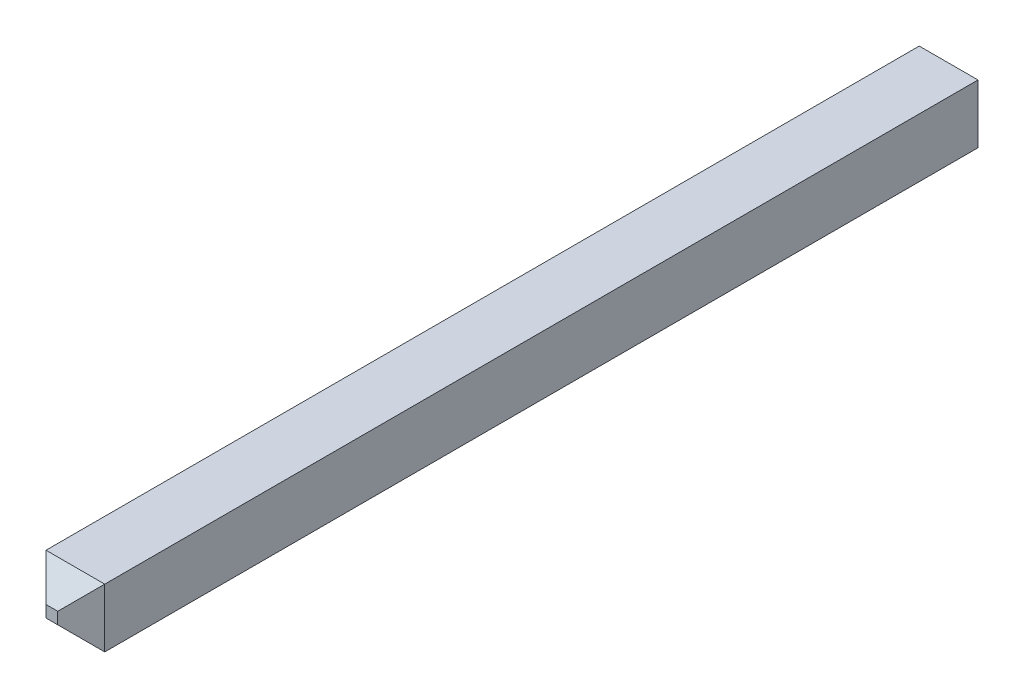
ISO-10303-21;
HEADER;
FILE_DESCRIPTION(('STEP AP214'),'2;1');
FILE_NAME('part.step','',(''),(''),'','','');
FILE_SCHEMA(('AUTOMOTIVE_DESIGN { 1 0 10303 214 1 1 1 1 }'));
ENDSEC;
DATA;
#1=APPLICATION_CONTEXT('core data for automotive mechanical design processes');
#2=APPLICATION_PROTOCOL_DEFINITION('international standard','automotive_design',2000,#1);
#3=PRODUCT_CONTEXT('',#1,'mechanical');
#4=PRODUCT('Part','Part','',(#3));
#5=PRODUCT_RELATED_PRODUCT_CATEGORY('part','',(#4));
#6=PRODUCT_DEFINITION_FORMATION('','',#4);
#7=PRODUCT_DEFINITION_CONTEXT('part definition',#1,'design');
#8=PRODUCT_DEFINITION('design','',#6,#7);
#9=PRODUCT_DEFINITION_SHAPE('','',#8);
#10=(LENGTH_UNIT() NAMED_UNIT(*) SI_UNIT(.MILLI.,.METRE.));
#11=(NAMED_UNIT(*) PLANE_ANGLE_UNIT() SI_UNIT($,.RADIAN.));
#12=(NAMED_UNIT(*) SI_UNIT($,.STERADIAN.) SOLID_ANGLE_UNIT());
#13=UNCERTAINTY_MEASURE_WITH_UNIT(LENGTH_MEASURE(1.E-05),#10,'distance_accuracy_value','');
#14=(GEOMETRIC_REPRESENTATION_CONTEXT(3) GLOBAL_UNCERTAINTY_ASSIGNED_CONTEXT((#13)) GLOBAL_UNIT_ASSIGNED_CONTEXT((#10,
#11,#12)) REPRESENTATION_CONTEXT('',''));
#15=CARTESIAN_POINT('',(0.,0.,0.));
#16=DIRECTION('',(0.,0.,1.));
#17=DIRECTION('',(1.,0.,0.));
#18=AXIS2_PLACEMENT_3D('',#15,#16,#17);
#19=CARTESIAN_POINT('',(1.39830129446248,-0.537194348002029,0.400212598425197));
#20=DIRECTION('',(0.,-0.707106781186544,0.707106781186551));
#21=DIRECTION('',(0.,-0.707106781186551,-0.707106781186544));
#22=AXIS2_PLACEMENT_3D('',#19,#20,#21);
#23=PLANE('',#22);
#24=DIRECTION('',(-1.,0.,0.));
#25=VECTOR('',#24,1.);
#26=CARTESIAN_POINT('',(1.3788131054861,-0.537784899183132,0.399622047244095));
#27=LINE('',#26,#25);
#28=CARTESIAN_POINT('',(1.38501389288767,-0.537784899183132,0.399622047244095));
#29=VERTEX_POINT('',#28);
#30=CARTESIAN_POINT('',(1.37910838107665,-0.537784899183132,0.399622047244095));
#31=VERTEX_POINT('',#30);
#32=EDGE_CURVE('E20',#29,#31,#27,.T.);
#33=ORIENTED_EDGE('',*,*,#32,.T.);
#34=DIRECTION('',(-0.577350269189659,-0.577350269189564,-0.577350269189654));
#35=VECTOR('',#34,1.);
#36=CARTESIAN_POINT('',(1.37910838107665,-0.537784899183132,0.399622047244096));
#37=LINE('',#36,#35);
#38=CARTESIAN_POINT('',(1.3672973574546,-0.549595922805179,0.387811023622047));
#39=VERTEX_POINT('',#38);
#40=EDGE_CURVE('E84',#31,#39,#37,.T.);
#41=ORIENTED_EDGE('',*,*,#40,.T.);
#42=DIRECTION('',(1.,0.,0.));
#43=VECTOR('',#42,1.);
#44=CARTESIAN_POINT('',(1.36582097950185,-0.549595922805179,0.387811023622047));
#45=LINE('',#44,#43);
#46=CARTESIAN_POINT('',(1.39682491650972,-0.549595922805179,0.387811023622047));
#47=VERTEX_POINT('',#46);
#48=EDGE_CURVE('E104',#47,#39,#45,.F.);
#49=ORIENTED_EDGE('',*,*,#48,.F.);
#50=DIRECTION('',(0.57735026918966,-0.577350269189565,-0.577350269189652));
#51=VECTOR('',#50,1.);
#52=CARTESIAN_POINT('',(1.38501389288767,-0.537784899183132,0.399622047244096));
#53=LINE('',#52,#51);
#54=EDGE_CURVE('E80',#29,#47,#53,.T.);
#55=ORIENTED_EDGE('',*,*,#54,.F.);
#56=EDGE_LOOP('',(#33,#41,#49,#55));
#57=FACE_BOUND('',#56,.T.);
#58=ADVANCED_FACE('F17',(#57),#23,.T.);
#59=CARTESIAN_POINT('',(1.36582097950185,-0.550186473986281,-0.0505748031496063));
#60=DIRECTION('',(0.,0.707106781186552,0.707106781186543));
#61=DIRECTION('',(0.,-0.707106781186543,0.707106781186552));
#62=AXIS2_PLACEMENT_3D('',#59,#60,#61);
#63=PLANE('',#62);
#64=DIRECTION('',(0.577350269189648,-0.577350269189574,0.577350269189655));
#65=VECTOR('',#64,1.);
#66=CARTESIAN_POINT('',(1.38501389288767,-0.537784899183132,-0.0629763779527562));
#67=LINE('',#66,#65);
#68=CARTESIAN_POINT('',(1.38501389288767,-0.537784899183132,-0.062976377952756));
#69=VERTEX_POINT('',#68);
#70=CARTESIAN_POINT('',(1.39682491650972,-0.549595922805179,-0.0511653543307084));
#71=VERTEX_POINT('',#70);
#72=EDGE_CURVE('E121',#69,#71,#67,.T.);
#73=ORIENTED_EDGE('',*,*,#72,.T.);
#74=DIRECTION('',(1.,0.,0.));
#75=VECTOR('',#74,1.);
#76=CARTESIAN_POINT('',(1.36582097950185,-0.549595922805179,-0.0511653543307086));
#77=LINE('',#76,#75);
#78=CARTESIAN_POINT('',(1.3672973574546,-0.549595922805179,-0.0511653543307082));
#79=VERTEX_POINT('',#78);
#80=EDGE_CURVE('E106',#79,#71,#77,.T.);
#81=ORIENTED_EDGE('',*,*,#80,.F.);
#82=DIRECTION('',(-0.577350269189653,-0.577350269189568,0.577350269189657));
#83=VECTOR('',#82,1.);
#84=CARTESIAN_POINT('',(1.37910838107665,-0.537784899183132,-0.0629763779527564));
#85=LINE('',#84,#83);
#86=CARTESIAN_POINT('',(1.37910838107665,-0.537784899183132,-0.062976377952756));
#87=VERTEX_POINT('',#86);
#88=EDGE_CURVE('E109',#87,#79,#85,.T.);
#89=ORIENTED_EDGE('',*,*,#88,.F.);
#90=DIRECTION('',(-1.,0.,0.));
#91=VECTOR('',#90,1.);
#92=CARTESIAN_POINT('',(1.3788131054861,-0.537784899183132,-0.062976377952756));
#93=LINE('',#92,#91);
#94=EDGE_CURVE('E112',#69,#87,#93,.T.);
#95=ORIENTED_EDGE('',*,*,#94,.F.);
#96=EDGE_LOOP('',(#73,#81,#89,#95));
#97=FACE_BOUND('',#96,.T.);
#98=ADVANCED_FACE('F176',(#97),#63,.F.);
#99=CARTESIAN_POINT('',(1.3788131054861,-0.538080174773683,0.399622047244095));
#100=DIRECTION('',(0.,0.,-1.));
#101=DIRECTION('',(-1.,0.,0.));
#102=AXIS2_PLACEMENT_3D('',#99,#100,#101);
#103=PLANE('',#102);
#104=DIRECTION('',(0.,1.,0.));
#105=VECTOR('',#104,1.);
#106=CARTESIAN_POINT('',(1.38501389288767,-0.518591985797305,0.399622047244096));
#107=LINE('',#106,#105);
#108=CARTESIAN_POINT('',(1.38501389288767,-0.531879387372108,0.399622047244095));
#109=VERTEX_POINT('',#108);
#110=EDGE_CURVE('E100',#109,#29,#107,.F.);
#111=ORIENTED_EDGE('',*,*,#110,.F.);
#112=DIRECTION('',(1.,0.,0.));
#113=VECTOR('',#112,1.);
#114=CARTESIAN_POINT('',(1.36582097950185,-0.531879387372108,0.399622047244095));
#115=LINE('',#114,#113);
#116=CARTESIAN_POINT('',(1.37910838107665,-0.531879387372108,0.399622047244095));
#117=VERTEX_POINT('',#116);
#118=EDGE_CURVE('E92',#117,#109,#115,.T.);
#119=ORIENTED_EDGE('',*,*,#118,.F.);
#120=DIRECTION('',(0.,1.,0.));
#121=VECTOR('',#120,1.);
#122=CARTESIAN_POINT('',(1.37910838107665,-0.518591985797305,0.399622047244096));
#123=LINE('',#122,#121);
#124=EDGE_CURVE('E88',#117,#31,#123,.F.);
#125=ORIENTED_EDGE('',*,*,#124,.T.);
#126=ORIENTED_EDGE('',*,*,#32,.F.);
#127=EDGE_LOOP('',(#111,#119,#125,#126));
#128=FACE_BOUND('',#127,.T.);
#129=ADVANCED_FACE('F90',(#128),#103,.F.);
#130=CARTESIAN_POINT('',(1.37969893225775,-0.518591985797305,0.400212598425197));
#131=DIRECTION('',(0.707106781186544,0.,-0.707106781186551));
#132=DIRECTION('',(-0.707106781186551,0.,-0.707106781186544));
#133=AXIS2_PLACEMENT_3D('',#130,#131,#132);
#134=PLANE('',#133);
#135=ORIENTED_EDGE('',*,*,#124,.F.);
#136=DIRECTION('',(0.577350269189695,-0.577350269189594,0.577350269189589));
#137=VECTOR('',#136,1.);
#138=CARTESIAN_POINT('',(1.3672973574546,-0.52006836375006,0.387811023622047));
#139=LINE('',#138,#137);
#140=CARTESIAN_POINT('',(1.3672973574546,-0.52006836375006,0.387811023622047));
#141=VERTEX_POINT('',#140);
#142=EDGE_CURVE('E133',#141,#117,#139,.T.);
#143=ORIENTED_EDGE('',*,*,#142,.F.);
#144=DIRECTION('',(0.,1.,0.));
#145=VECTOR('',#144,1.);
#146=CARTESIAN_POINT('',(1.3672973574546,-0.551072300757935,0.387811023622047));
#147=LINE('',#146,#145);
#148=EDGE_CURVE('E97',#141,#39,#147,.F.);
#149=ORIENTED_EDGE('',*,*,#148,.T.);
#150=ORIENTED_EDGE('',*,*,#40,.F.);
#151=EDGE_LOOP('',(#135,#143,#149,#150));
#152=FACE_BOUND('',#151,.T.);
#153=ADVANCED_FACE('F95',(#152),#134,.F.);
#154=CARTESIAN_POINT('',(1.38442334170657,-0.518591985797305,0.400212598425197));
#155=DIRECTION('',(0.707106781186544,0.,0.707106781186551));
#156=DIRECTION('',(0.707106781186551,0.,-0.707106781186544));
#157=AXIS2_PLACEMENT_3D('',#154,#155,#156);
#158=PLANE('',#157);
#159=DIRECTION('',(0.577350269189688,0.577350269189598,-0.577350269189592));
#160=VECTOR('',#159,1.);
#161=CARTESIAN_POINT('',(1.38501389288767,-0.531879387372108,0.399622047244095));
#162=LINE('',#161,#160);
#163=CARTESIAN_POINT('',(1.39682491650972,-0.52006836375006,0.387811023622047));
#164=VERTEX_POINT('',#163);
#165=EDGE_CURVE('E130',#109,#164,#162,.T.);
#166=ORIENTED_EDGE('',*,*,#165,.F.);
#167=ORIENTED_EDGE('',*,*,#110,.T.);
#168=ORIENTED_EDGE('',*,*,#54,.T.);
#169=DIRECTION('',(0.,1.,0.));
#170=VECTOR('',#169,1.);
#171=CARTESIAN_POINT('',(1.39682491650972,-0.551072300757935,0.387811023622047));
#172=LINE('',#171,#170);
#173=EDGE_CURVE('E135',#164,#47,#172,.F.);
#174=ORIENTED_EDGE('',*,*,#173,.F.);
#175=EDGE_LOOP('',(#166,#167,#168,#174));
#176=FACE_BOUND('',#175,.T.);
#177=ADVANCED_FACE('F186',(#176),#158,.T.);
#178=CARTESIAN_POINT('',(1.36582097950185,-0.549595922805179,0.152181102362205));
#179=DIRECTION('',(0.,-1.,0.));
#180=DIRECTION('',(1.,0.,0.));
#181=AXIS2_PLACEMENT_3D('',#178,#179,#180);
#182=PLANE('',#181);
#183=DIRECTION('',(0.,0.,1.));
#184=VECTOR('',#183,1.);
#185=CARTESIAN_POINT('',(1.3672973574546,-0.549595922805179,0.152181102362205));
#186=LINE('',#185,#184);
#187=EDGE_CURVE('E126',#39,#79,#186,.F.);
#188=ORIENTED_EDGE('',*,*,#187,.T.);
#189=ORIENTED_EDGE('',*,*,#80,.T.);
#190=DIRECTION('',(0.,0.,1.));
#191=VECTOR('',#190,1.);
#192=CARTESIAN_POINT('',(1.39682491650972,-0.549595922805179,0.152181102362205));
#193=LINE('',#192,#191);
#194=EDGE_CURVE('E138',#47,#71,#193,.F.);
#195=ORIENTED_EDGE('',*,*,#194,.F.);
#196=ORIENTED_EDGE('',*,*,#48,.T.);
#197=EDGE_LOOP('',(#188,#189,#195,#196));
#198=FACE_BOUND('',#197,.T.);
#199=ADVANCED_FACE('F179',(#198),#182,.T.);
#200=CARTESIAN_POINT('',(1.3667068062735,-0.551072300757935,-0.0505748031496063));
#201=DIRECTION('',(-0.707106781186552,0.,-0.707106781186543));
#202=DIRECTION('',(-0.707106781186543,0.,0.707106781186552));
#203=AXIS2_PLACEMENT_3D('',#200,#201,#202);
#204=PLANE('',#203);
#205=DIRECTION('',(0.577350269189704,-0.577350269189582,-0.577350269189591));
#206=VECTOR('',#205,1.);
#207=CARTESIAN_POINT('',(1.3672973574546,-0.52006836375006,-0.0511653543307085));
#208=LINE('',#207,#206);
#209=CARTESIAN_POINT('',(1.3672973574546,-0.52006836375006,-0.051165354330708));
#210=VERTEX_POINT('',#209);
#211=CARTESIAN_POINT('',(1.37910838107665,-0.531879387372108,-0.0629763779527563));
#212=VERTEX_POINT('',#211);
#213=EDGE_CURVE('E143',#210,#212,#208,.T.);
#214=ORIENTED_EDGE('',*,*,#213,.T.);
#215=DIRECTION('',(0.,1.,0.));
#216=VECTOR('',#215,1.);
#217=CARTESIAN_POINT('',(1.37910838107665,-0.538080174773683,-0.062976377952756));
#218=LINE('',#217,#216);
#219=EDGE_CURVE('E115',#87,#212,#218,.T.);
#220=ORIENTED_EDGE('',*,*,#219,.F.);
#221=ORIENTED_EDGE('',*,*,#88,.T.);
#222=DIRECTION('',(0.,1.,0.));
#223=VECTOR('',#222,1.);
#224=CARTESIAN_POINT('',(1.3672973574546,-0.551072300757935,-0.0511653543307086));
#225=LINE('',#224,#223);
#226=EDGE_CURVE('E123',#79,#210,#225,.T.);
#227=ORIENTED_EDGE('',*,*,#226,.T.);
#228=EDGE_LOOP('',(#214,#220,#221,#227));
#229=FACE_BOUND('',#228,.T.);
#230=ADVANCED_FACE('F170',(#229),#204,.T.);
#231=CARTESIAN_POINT('',(1.3788131054861,-0.538080174773683,-0.062976377952756));
#232=DIRECTION('',(0.,0.,-1.));
#233=DIRECTION('',(-1.,0.,0.));
#234=AXIS2_PLACEMENT_3D('',#231,#232,#233);
#235=PLANE('',#234);
#236=ORIENTED_EDGE('',*,*,#94,.T.);
#237=ORIENTED_EDGE('',*,*,#219,.T.);
#238=DIRECTION('',(1.,0.,0.));
#239=VECTOR('',#238,1.);
#240=CARTESIAN_POINT('',(1.39830129446248,-0.531879387372108,-0.0629763779527563));
#241=LINE('',#240,#239);
#242=CARTESIAN_POINT('',(1.38501389288767,-0.531879387372108,-0.0629763779527561));
#243=VERTEX_POINT('',#242);
#244=EDGE_CURVE('E145',#212,#243,#241,.T.);
#245=ORIENTED_EDGE('',*,*,#244,.T.);
#246=DIRECTION('',(0.,1.,0.));
#247=VECTOR('',#246,1.);
#248=CARTESIAN_POINT('',(1.38501389288767,-0.551072300757935,-0.0629763779527562));
#249=LINE('',#248,#247);
#250=EDGE_CURVE('E118',#243,#69,#249,.F.);
#251=ORIENTED_EDGE('',*,*,#250,.T.);
#252=EDGE_LOOP('',(#236,#237,#245,#251));
#253=FACE_BOUND('',#252,.T.);
#254=ADVANCED_FACE('F174',(#253),#235,.T.);
#255=CARTESIAN_POINT('',(1.39741546769082,-0.551072300757935,-0.0505748031496063));
#256=DIRECTION('',(-0.707106781186552,0.,0.707106781186543));
#257=DIRECTION('',(0.707106781186543,0.,0.707106781186552));
#258=AXIS2_PLACEMENT_3D('',#255,#256,#257);
#259=PLANE('',#258);
#260=ORIENTED_EDGE('',*,*,#250,.F.);
#261=DIRECTION('',(0.577350269189697,0.577350269189586,0.577350269189594));
#262=VECTOR('',#261,1.);
#263=CARTESIAN_POINT('',(1.38501389288767,-0.531879387372108,-0.0629763779527563));
#264=LINE('',#263,#262);
#265=CARTESIAN_POINT('',(1.39682491650972,-0.52006836375006,-0.051165354330708));
#266=VERTEX_POINT('',#265);
#267=EDGE_CURVE('E35',#243,#266,#264,.T.);
#268=ORIENTED_EDGE('',*,*,#267,.T.);
#269=DIRECTION('',(0.,1.,0.));
#270=VECTOR('',#269,1.);
#271=CARTESIAN_POINT('',(1.39682491650972,-0.551072300757935,-0.0511653543307086));
#272=LINE('',#271,#270);
#273=EDGE_CURVE('E141',#71,#266,#272,.T.);
#274=ORIENTED_EDGE('',*,*,#273,.F.);
#275=ORIENTED_EDGE('',*,*,#72,.F.);
#276=EDGE_LOOP('',(#260,#268,#274,#275));
#277=FACE_BOUND('',#276,.T.);
#278=ADVANCED_FACE('F209',(#277),#259,.F.);
#279=CARTESIAN_POINT('',(1.3672973574546,-0.551072300757935,0.152181102362205));
#280=DIRECTION('',(1.,0.,0.));
#281=DIRECTION('',(0.,1.,0.));
#282=AXIS2_PLACEMENT_3D('',#279,#280,#281);
#283=PLANE('',#282);
#284=ORIENTED_EDGE('',*,*,#148,.F.);
#285=DIRECTION('',(0.,0.,1.));
#286=VECTOR('',#285,1.);
#287=CARTESIAN_POINT('',(1.3672973574546,-0.52006836375006,0.152181102362205));
#288=LINE('',#287,#286);
#289=EDGE_CURVE('E148',#210,#141,#288,.T.);
#290=ORIENTED_EDGE('',*,*,#289,.F.);
#291=ORIENTED_EDGE('',*,*,#226,.F.);
#292=ORIENTED_EDGE('',*,*,#187,.F.);
#293=EDGE_LOOP('',(#284,#290,#291,#292));
#294=FACE_BOUND('',#293,.T.);
#295=ADVANCED_FACE('F181',(#294),#283,.F.);
#296=CARTESIAN_POINT('',(1.36582097950185,-0.53246993855321,0.400212598425197));
#297=DIRECTION('',(0.,0.707106781186544,0.707106781186551));
#298=DIRECTION('',(0.,-0.707106781186551,0.707106781186544));
#299=AXIS2_PLACEMENT_3D('',#296,#297,#298);
#300=PLANE('',#299);
#301=DIRECTION('',(-1.,0.,0.));
#302=VECTOR('',#301,1.);
#303=CARTESIAN_POINT('',(1.39830129446248,-0.52006836375006,0.387811023622047));
#304=LINE('',#303,#302);
#305=EDGE_CURVE('E151',#141,#164,#304,.F.);
#306=ORIENTED_EDGE('',*,*,#305,.F.);
#307=ORIENTED_EDGE('',*,*,#142,.T.);
#308=ORIENTED_EDGE('',*,*,#118,.T.);
#309=ORIENTED_EDGE('',*,*,#165,.T.);
#310=EDGE_LOOP('',(#306,#307,#308,#309));
#311=FACE_BOUND('',#310,.T.);
#312=ADVANCED_FACE('F183',(#311),#300,.T.);
#313=CARTESIAN_POINT('',(1.39682491650972,-0.551072300757935,0.152181102362205));
#314=DIRECTION('',(1.,0.,0.));
#315=DIRECTION('',(0.,1.,0.));
#316=AXIS2_PLACEMENT_3D('',#313,#314,#315);
#317=PLANE('',#316);
#318=ORIENTED_EDGE('',*,*,#194,.T.);
#319=ORIENTED_EDGE('',*,*,#273,.T.);
#320=DIRECTION('',(0.,0.,1.));
#321=VECTOR('',#320,1.);
#322=CARTESIAN_POINT('',(1.39682491650972,-0.52006836375006,0.152181102362205));
#323=LINE('',#322,#321);
#324=EDGE_CURVE('E26',#164,#266,#323,.F.);
#325=ORIENTED_EDGE('',*,*,#324,.F.);
#326=ORIENTED_EDGE('',*,*,#173,.T.);
#327=EDGE_LOOP('',(#318,#319,#325,#326));
#328=FACE_BOUND('',#327,.T.);
#329=ADVANCED_FACE('F161',(#328),#317,.T.);
#330=CARTESIAN_POINT('',(1.39830129446248,-0.519477812568958,-0.0505748031496063));
#331=DIRECTION('',(0.,-0.707106781186552,0.707106781186543));
#332=DIRECTION('',(0.,-0.707106781186543,-0.707106781186552));
#333=AXIS2_PLACEMENT_3D('',#330,#331,#332);
#334=PLANE('',#333);
#335=ORIENTED_EDGE('',*,*,#267,.F.);
#336=ORIENTED_EDGE('',*,*,#244,.F.);
#337=ORIENTED_EDGE('',*,*,#213,.F.);
#338=DIRECTION('',(-1.,0.,0.));
#339=VECTOR('',#338,1.);
#340=CARTESIAN_POINT('',(1.39830129446248,-0.52006836375006,-0.0511653543307086));
#341=LINE('',#340,#339);
#342=EDGE_CURVE('E11',#266,#210,#341,.T.);
#343=ORIENTED_EDGE('',*,*,#342,.F.);
#344=EDGE_LOOP('',(#335,#336,#337,#343));
#345=FACE_BOUND('',#344,.T.);
#346=ADVANCED_FACE('F166',(#345),#334,.F.);
#347=CARTESIAN_POINT('',(1.39830129446248,-0.52006836375006,0.152181102362205));
#348=DIRECTION('',(0.,1.,0.));
#349=DIRECTION('',(-1.,0.,0.));
#350=AXIS2_PLACEMENT_3D('',#347,#348,#349);
#351=PLANE('',#350);
#352=ORIENTED_EDGE('',*,*,#324,.T.);
#353=ORIENTED_EDGE('',*,*,#342,.T.);
#354=ORIENTED_EDGE('',*,*,#289,.T.);
#355=ORIENTED_EDGE('',*,*,#305,.T.);
#356=EDGE_LOOP('',(#352,#353,#354,#355));
#357=FACE_BOUND('',#356,.T.);
#358=ADVANCED_FACE('F157',(#357),#351,.T.);
#359=CLOSED_SHELL('',(#58,#98,#129,#153,#177,#199,#230,#254,#278,#295,#312,#329,#346,#358));
#360=MANIFOLD_SOLID_BREP('B1',#359);
#361=ADVANCED_BREP_SHAPE_REPRESENTATION('',(#18,#360),#14);
#362=SHAPE_DEFINITION_REPRESENTATION(#9,#361);
ENDSEC;
END-ISO-10303-21;
